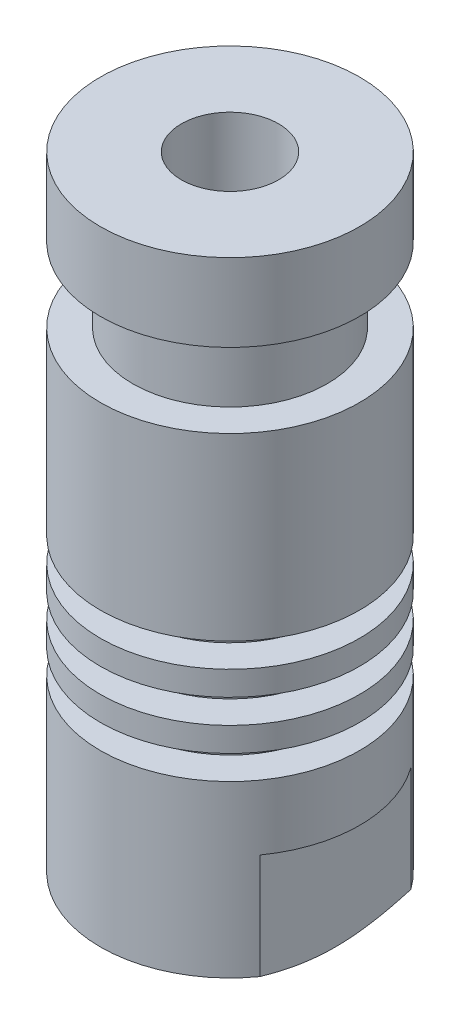
ISO-10303-21;
HEADER;
FILE_DESCRIPTION(('STEP AP214'),'2;1');
FILE_NAME('part.step','',(''),(''),'','','');
FILE_SCHEMA(('AUTOMOTIVE_DESIGN { 1 0 10303 214 1 1 1 1 }'));
ENDSEC;
DATA;
#1=APPLICATION_CONTEXT('core data for automotive mechanical design processes');
#2=APPLICATION_PROTOCOL_DEFINITION('international standard','automotive_design',2000,#1);
#3=PRODUCT_CONTEXT('',#1,'mechanical');
#4=PRODUCT('Part','Part','',(#3));
#5=PRODUCT_RELATED_PRODUCT_CATEGORY('part','',(#4));
#6=PRODUCT_DEFINITION_FORMATION('','',#4);
#7=PRODUCT_DEFINITION_CONTEXT('part definition',#1,'design');
#8=PRODUCT_DEFINITION('design','',#6,#7);
#9=PRODUCT_DEFINITION_SHAPE('','',#8);
#10=(LENGTH_UNIT() NAMED_UNIT(*) SI_UNIT(.MILLI.,.METRE.));
#11=(NAMED_UNIT(*) PLANE_ANGLE_UNIT() SI_UNIT($,.RADIAN.));
#12=(NAMED_UNIT(*) SI_UNIT($,.STERADIAN.) SOLID_ANGLE_UNIT());
#13=UNCERTAINTY_MEASURE_WITH_UNIT(LENGTH_MEASURE(1.E-05),#10,'distance_accuracy_value','');
#14=(GEOMETRIC_REPRESENTATION_CONTEXT(3) GLOBAL_UNCERTAINTY_ASSIGNED_CONTEXT((#13)) GLOBAL_UNIT_ASSIGNED_CONTEXT((#10,
#11,#12)) REPRESENTATION_CONTEXT('',''));
#15=CARTESIAN_POINT('',(0.,0.,0.));
#16=DIRECTION('',(0.,0.,1.));
#17=DIRECTION('',(1.,0.,0.));
#18=AXIS2_PLACEMENT_3D('',#15,#16,#17);
#19=CARTESIAN_POINT('',(0.,1.5,0.));
#20=DIRECTION('',(0.,1.,0.));
#21=DIRECTION('',(0.,0.,1.));
#22=AXIS2_PLACEMENT_3D('',#19,#20,#21);
#23=CONICAL_SURFACE('',#22,7.99999999999999,1.10714871779409);
#24=CARTESIAN_POINT('',(0.,0.,0.));
#25=DIRECTION('',(0.,1.,0.));
#26=DIRECTION('',(0.,0.,1.));
#27=AXIS2_PLACEMENT_3D('',#24,#25,#26);
#28=CIRCLE('',#27,4.99999999999998);
#29=CARTESIAN_POINT('',(0.,0.,4.99999999999998));
#30=VERTEX_POINT('',#29);
#31=EDGE_CURVE('E11',#30,#30,#28,.T.);
#32=ORIENTED_EDGE('',*,*,#31,.T.);
#33=EDGE_LOOP('',(#32));
#34=FACE_BOUND('',#33,.T.);
#35=CARTESIAN_POINT('',(0.,1.5,0.));
#36=DIRECTION('',(0.,1.,0.));
#37=DIRECTION('',(0.,0.,1.));
#38=AXIS2_PLACEMENT_3D('',#35,#36,#37);
#39=CIRCLE('',#38,7.99999999999999);
#40=CARTESIAN_POINT('',(6.49999999999997,1.5,-4.66368952654442));
#41=VERTEX_POINT('',#40);
#42=CARTESIAN_POINT('',(-6.49999999999997,1.5,-4.66368952654442));
#43=VERTEX_POINT('',#42);
#44=EDGE_CURVE('E91',#41,#43,#39,.T.);
#45=ORIENTED_EDGE('',*,*,#44,.F.);
#46=CARTESIAN_POINT('',(6.49999999999999,4.63960517836139,-12.7140020611741));
#47=CARTESIAN_POINT('',(6.49999999999999,4.49493273691476,-12.3889791438294));
#48=CARTESIAN_POINT('',(6.49999999999999,4.35117750702607,-12.0635434352985));
#49=CARTESIAN_POINT('',(6.49999999999999,4.06600795170587,-11.4116234990025));
#50=CARTESIAN_POINT('',(6.49999999999999,3.92459377917146,-11.0851392044028));
#51=CARTESIAN_POINT('',(6.49999999999999,3.64433543055072,-10.4302489102803));
#52=CARTESIAN_POINT('',(6.49999999999999,3.50549732908588,-10.1018403056813));
#53=CARTESIAN_POINT('',(6.49999999999999,3.23142571950738,-9.44352872623451));
#54=CARTESIAN_POINT('',(6.49999999999999,3.09619212071106,-9.11362578922608));
#55=CARTESIAN_POINT('',(6.49999999999999,2.83048289305681,-8.45250376338199));
#56=CARTESIAN_POINT('',(6.49999999999999,2.70000014874712,-8.12128754257229));
#57=CARTESIAN_POINT('',(6.49999999999999,2.44483186701764,-7.45659634827721));
#58=CARTESIAN_POINT('',(6.49999999999999,2.32014667007343,-7.12312124344746));
#59=CARTESIAN_POINT('',(6.49999999999999,2.07840099908305,-6.45372644486896));
#60=CARTESIAN_POINT('',(6.49999999999999,1.96133416663675,-6.11780905674865));
#61=CARTESIAN_POINT('',(6.49999999999999,1.73702665581905,-5.44272397498847));
#62=CARTESIAN_POINT('',(6.49999999999999,1.62978438251793,-5.10355681882979));
#63=CARTESIAN_POINT('',(6.49999999999999,1.50145760944831,-4.66929022803816));
#64=CARTESIAN_POINT('',(6.49999999999999,1.47439812441263,-4.57594563698323));
#65=CARTESIAN_POINT('',(6.49999999999999,1.42132141191772,-4.38896083134469));
#66=CARTESIAN_POINT('',(6.49999999999999,1.39530416853117,-4.29532062130229));
#67=CARTESIAN_POINT('',(6.49999999999999,1.31884649816979,-4.01363447591895));
#68=CARTESIAN_POINT('',(6.49999999999999,1.27009239909997,-3.82513345071698));
#69=CARTESIAN_POINT('',(6.49999999999999,1.13144347216063,-3.25712110004858));
#70=CARTESIAN_POINT('',(6.49999999999999,1.04932049996449,-2.87562365996438));
#71=CARTESIAN_POINT('',(6.49999999999999,0.946261094020701,-2.29977813127616));
#72=CARTESIAN_POINT('',(6.49999999999999,0.915259699355964,-2.10720712065049));
#73=CARTESIAN_POINT('',(6.49999999999999,0.860714592579146,-1.7210183720728));
#74=CARTESIAN_POINT('',(6.49999999999999,0.837170046736164,-1.52740075360301));
#75=CARTESIAN_POINT('',(6.49999999999999,0.798232474629815,-1.13985753736791));
#76=CARTESIAN_POINT('',(6.49999999999999,0.78281812154265,-0.945934097286736));
#77=CARTESIAN_POINT('',(6.49999999999999,0.760510527948946,-0.557594838663115));
#78=CARTESIAN_POINT('',(6.49999999999999,0.753617189046767,-0.363179025832271));
#79=CARTESIAN_POINT('',(6.49999999999999,0.748572275423311,0.0257307608028582));
#80=CARTESIAN_POINT('',(6.49999999999999,0.750419038007415,0.220224712703199));
#81=CARTESIAN_POINT('',(6.49999999999999,0.76278940638265,0.608953775199544));
#82=CARTESIAN_POINT('',(6.49999999999999,0.773314033718197,0.803188852624818));
#83=CARTESIAN_POINT('',(6.49999999999999,0.806501889662758,1.24090602694894));
#84=CARTESIAN_POINT('',(6.49999999999999,0.831590920516132,1.48420561931385));
#85=CARTESIAN_POINT('',(6.49999999999999,0.893852125406738,1.96924724220696));
#86=CARTESIAN_POINT('',(6.49999999999999,0.931025317420885,2.21098913976373));
#87=CARTESIAN_POINT('',(6.49999999999999,1.01604103903786,2.69277716302994));
#88=CARTESIAN_POINT('',(6.49999999999999,1.06389244038228,2.93282170644527));
#89=CARTESIAN_POINT('',(6.49999999999999,1.16871694054054,3.41088019593747));
#90=CARTESIAN_POINT('',(6.49999999999999,1.22568964445531,3.64889422945387));
#91=CARTESIAN_POINT('',(6.49999999999999,1.34820588611418,4.1264246278799));
#92=CARTESIAN_POINT('',(6.49999999999999,1.41386316573231,4.36591159529887));
#93=CARTESIAN_POINT('',(6.49999999999999,1.55170831935892,4.84285142414976));
#94=CARTESIAN_POINT('',(6.49999999999999,1.62389277522808,5.08030527977033));
#95=CARTESIAN_POINT('',(6.49999999999999,1.77367698683179,5.55344813381403));
#96=CARTESIAN_POINT('',(6.49999999999999,1.85127585874315,5.78913741335531));
#97=CARTESIAN_POINT('',(6.49999999999999,2.01097599435672,6.2590172847031));
#98=CARTESIAN_POINT('',(6.49999999999999,2.09307790629008,6.49320765528824));
#99=CARTESIAN_POINT('',(6.49999999999999,2.28703034641471,7.03262988490792));
#100=CARTESIAN_POINT('',(6.49999999999999,2.40021373679549,7.33738166221177));
#101=CARTESIAN_POINT('',(6.49999999999999,2.63161506867892,7.94497276131788));
#102=CARTESIAN_POINT('',(6.49999999999999,2.74983321640616,8.24781200419785));
#103=CARTESIAN_POINT('',(6.49999999999999,2.99028703034095,8.8519169939098));
#104=CARTESIAN_POINT('',(6.49999999999999,3.11252303289466,9.15318260654962));
#105=CARTESIAN_POINT('',(6.49999999999999,3.36022795848007,9.75438363657073));
#106=CARTESIAN_POINT('',(6.49999999999999,3.4856969285348,10.0543190345298));
#107=CARTESIAN_POINT('',(6.49999999999999,3.8662108131295,10.9529295272112));
#108=CARTESIAN_POINT('',(6.49999999999999,4.12517530296346,11.5499439611486));
#109=CARTESIAN_POINT('',(6.49999999999999,4.65016432189855,12.7407935160942));
#110=CARTESIAN_POINT('',(6.49999999999999,4.91618837224115,13.334628849434));
#111=CARTESIAN_POINT('',(6.49999999999999,5.43683739745572,14.4837436524848));
#112=CARTESIAN_POINT('',(6.49999999999999,5.69116368566189,15.0391586745477));
#113=CARTESIAN_POINT('',(6.49999999999999,6.20312748367828,16.148471829484));
#114=CARTESIAN_POINT('',(6.49999999999999,6.46076506083453,16.7023699312269));
#115=CARTESIAN_POINT('',(6.49999999999999,6.97809934492668,17.8080180985776));
#116=CARTESIAN_POINT('',(6.49999999999999,7.23779164660991,18.3597702278274));
#117=CARTESIAN_POINT('',(6.49999999999999,7.75914833515714,19.4623190137403));
#118=CARTESIAN_POINT('',(6.49999999999999,8.02081265352454,20.0131157027799));
#119=CARTESIAN_POINT('',(6.49999999999999,8.28320577924075,20.5635626171586));
#120=B_SPLINE_CURVE_WITH_KNOTS('',3,(#46,#47,#48,#49,#50,#51,#52,#53,#54,#55,#56,#57,#58,#59,
#60,#61,#62,#63,#64,#65,#66,#67,#68,#69,#70,#71,#72,#73,#74,#75,#76,#77,#78,#79,#80,#81,#82,#83,
#84,#85,#86,#87,#88,#89,#90,#91,#92,#93,#94,#95,#96,#97,#98,#99,#100,#101,#102,#103,#104,#105,
#106,#107,#108,#109,#110,#111,#112,#113,#114,#115,#116,#117,#118,#119),.UNSPECIFIED.,.F.,.F.,(4,
2,2,2,2,2,2,2,2,2,2,2,2,2,2,2,2,2,2,2,2,2,2,2,2,2,2,2,2,2,2,2,2,2,2,2,4),(0.,1.06730515758636,
2.13467974924004,3.20431402837474,4.27392137202762,5.34185467005331,6.40985060614333,
7.47694343200912,8.54386271672926,8.83542135077924,9.12697552758702,9.71105511301348,
10.8808525348457,11.4658873460732,12.0508567229673,12.6342839007031,13.2177043413035,
13.8010137979488,14.3843919306593,15.1178129637762,15.8512957967343,16.5853903108169,
17.31945305149,18.0643130987016,18.8087853133975,19.5531362870632,20.2975946957999,
21.2728075860352,22.2480604596634,23.2233951834841,24.1987441014193,26.1509456097113,
28.1030150621006,29.9356240477088,31.7682703646555,33.5977016553135,35.4270696921721),.UNSPECIFIED.);
#121=CARTESIAN_POINT('',(6.49999999999997,1.5,4.66368952654442));
#122=VERTEX_POINT('',#121);
#123=EDGE_CURVE('E76',#122,#41,#120,.F.);
#124=ORIENTED_EDGE('',*,*,#123,.F.);
#125=CARTESIAN_POINT('',(-6.49999999999997,1.5,4.66368952654442));
#126=VERTEX_POINT('',#125);
#127=EDGE_CURVE('E43',#126,#122,#39,.T.);
#128=ORIENTED_EDGE('',*,*,#127,.F.);
#129=CARTESIAN_POINT('',(-6.49999999999999,4.63960517836139,-12.7140020611741));
#130=CARTESIAN_POINT('',(-6.49999999999999,4.49493273691476,-12.3889791438294));
#131=CARTESIAN_POINT('',(-6.49999999999999,4.35117750702607,-12.0635434352985));
#132=CARTESIAN_POINT('',(-6.49999999999999,4.06600795170587,-11.4116234990025));
#133=CARTESIAN_POINT('',(-6.49999999999999,3.92459377917146,-11.0851392044028));
#134=CARTESIAN_POINT('',(-6.49999999999999,3.64433543055072,-10.4302489102803));
#135=CARTESIAN_POINT('',(-6.49999999999999,3.50549732908588,-10.1018403056813));
#136=CARTESIAN_POINT('',(-6.49999999999999,3.23142571950738,-9.44352872623451));
#137=CARTESIAN_POINT('',(-6.49999999999999,3.09619212071106,-9.11362578922608));
#138=CARTESIAN_POINT('',(-6.49999999999999,2.83048289305681,-8.45250376338199));
#139=CARTESIAN_POINT('',(-6.49999999999999,2.70000014874712,-8.12128754257229));
#140=CARTESIAN_POINT('',(-6.49999999999999,2.44483186701764,-7.45659634827721));
#141=CARTESIAN_POINT('',(-6.49999999999999,2.32014667007343,-7.12312124344746));
#142=CARTESIAN_POINT('',(-6.49999999999999,2.07840099908305,-6.45372644486896));
#143=CARTESIAN_POINT('',(-6.49999999999999,1.96133416663675,-6.11780905674865));
#144=CARTESIAN_POINT('',(-6.49999999999999,1.73702665581905,-5.44272397498847));
#145=CARTESIAN_POINT('',(-6.49999999999999,1.62978438251793,-5.10355681882979));
#146=CARTESIAN_POINT('',(-6.49999999999999,1.50145760944831,-4.66929022803816));
#147=CARTESIAN_POINT('',(-6.49999999999999,1.47439812441263,-4.57594563698323));
#148=CARTESIAN_POINT('',(-6.49999999999999,1.42132141191772,-4.38896083134469));
#149=CARTESIAN_POINT('',(-6.49999999999999,1.39530416853117,-4.29532062130229));
#150=CARTESIAN_POINT('',(-6.49999999999999,1.31884649816979,-4.01363447591895));
#151=CARTESIAN_POINT('',(-6.49999999999999,1.27009239909997,-3.82513345071698));
#152=CARTESIAN_POINT('',(-6.49999999999999,1.13144347216063,-3.25712110004858));
#153=CARTESIAN_POINT('',(-6.49999999999999,1.04932049996449,-2.87562365996438));
#154=CARTESIAN_POINT('',(-6.49999999999999,0.946261094020701,-2.29977813127616));
#155=CARTESIAN_POINT('',(-6.49999999999999,0.915259699355964,-2.10720712065049));
#156=CARTESIAN_POINT('',(-6.49999999999999,0.860714592579146,-1.7210183720728));
#157=CARTESIAN_POINT('',(-6.49999999999999,0.837170046736164,-1.52740075360301));
#158=CARTESIAN_POINT('',(-6.49999999999999,0.798232474629815,-1.13985753736791));
#159=CARTESIAN_POINT('',(-6.49999999999999,0.78281812154265,-0.945934097286736));
#160=CARTESIAN_POINT('',(-6.49999999999999,0.760510527948946,-0.557594838663115));
#161=CARTESIAN_POINT('',(-6.49999999999999,0.753617189046767,-0.363179025832271));
#162=CARTESIAN_POINT('',(-6.49999999999999,0.748572275423311,0.0257307608028582));
#163=CARTESIAN_POINT('',(-6.49999999999999,0.750419038007415,0.220224712703199));
#164=CARTESIAN_POINT('',(-6.49999999999999,0.76278940638265,0.608953775199544));
#165=CARTESIAN_POINT('',(-6.49999999999999,0.773314033718197,0.803188852624818));
#166=CARTESIAN_POINT('',(-6.49999999999999,0.806501889662758,1.24090602694894));
#167=CARTESIAN_POINT('',(-6.49999999999999,0.831590920516132,1.48420561931385));
#168=CARTESIAN_POINT('',(-6.49999999999999,0.893852125406738,1.96924724220696));
#169=CARTESIAN_POINT('',(-6.49999999999999,0.931025317420885,2.21098913976373));
#170=CARTESIAN_POINT('',(-6.49999999999999,1.01604103903786,2.69277716302994));
#171=CARTESIAN_POINT('',(-6.49999999999999,1.06389244038228,2.93282170644527));
#172=CARTESIAN_POINT('',(-6.49999999999999,1.16871694054054,3.41088019593747));
#173=CARTESIAN_POINT('',(-6.49999999999999,1.22568964445531,3.64889422945387));
#174=CARTESIAN_POINT('',(-6.49999999999999,1.34820588611418,4.1264246278799));
#175=CARTESIAN_POINT('',(-6.49999999999999,1.41386316573231,4.36591159529887));
#176=CARTESIAN_POINT('',(-6.49999999999999,1.55170831935892,4.84285142414976));
#177=CARTESIAN_POINT('',(-6.49999999999999,1.62389277522808,5.08030527977033));
#178=CARTESIAN_POINT('',(-6.49999999999999,1.77367698683179,5.55344813381403));
#179=CARTESIAN_POINT('',(-6.49999999999999,1.85127585874315,5.78913741335531));
#180=CARTESIAN_POINT('',(-6.49999999999999,2.01097599435672,6.2590172847031));
#181=CARTESIAN_POINT('',(-6.49999999999999,2.09307790629008,6.49320765528824));
#182=CARTESIAN_POINT('',(-6.49999999999999,2.28703034641471,7.03262988490792));
#183=CARTESIAN_POINT('',(-6.49999999999999,2.40021373679549,7.33738166221177));
#184=CARTESIAN_POINT('',(-6.49999999999999,2.63161506867892,7.94497276131788));
#185=CARTESIAN_POINT('',(-6.49999999999999,2.74983321640616,8.24781200419785));
#186=CARTESIAN_POINT('',(-6.49999999999999,2.99028703034095,8.8519169939098));
#187=CARTESIAN_POINT('',(-6.49999999999999,3.11252303289466,9.15318260654962));
#188=CARTESIAN_POINT('',(-6.49999999999999,3.36022795848007,9.75438363657073));
#189=CARTESIAN_POINT('',(-6.49999999999999,3.4856969285348,10.0543190345298));
#190=CARTESIAN_POINT('',(-6.49999999999999,3.8662108131295,10.9529295272112));
#191=CARTESIAN_POINT('',(-6.49999999999999,4.12517530296346,11.5499439611486));
#192=CARTESIAN_POINT('',(-6.49999999999999,4.65016432189855,12.7407935160942));
#193=CARTESIAN_POINT('',(-6.49999999999999,4.91618837224115,13.334628849434));
#194=CARTESIAN_POINT('',(-6.49999999999999,5.43683739745572,14.4837436524848));
#195=CARTESIAN_POINT('',(-6.49999999999999,5.69116368566189,15.0391586745477));
#196=CARTESIAN_POINT('',(-6.49999999999999,6.20312748367828,16.148471829484));
#197=CARTESIAN_POINT('',(-6.49999999999999,6.46076506083453,16.7023699312269));
#198=CARTESIAN_POINT('',(-6.49999999999999,6.97809934492668,17.8080180985776));
#199=CARTESIAN_POINT('',(-6.49999999999999,7.23779164660991,18.3597702278274));
#200=CARTESIAN_POINT('',(-6.49999999999999,7.75914833515714,19.4623190137403));
#201=CARTESIAN_POINT('',(-6.49999999999999,8.02081265352454,20.0131157027799));
#202=CARTESIAN_POINT('',(-6.49999999999999,8.28320577924075,20.5635626171586));
#203=B_SPLINE_CURVE_WITH_KNOTS('',3,(#129,#130,#131,#132,#133,#134,#135,#136,#137,#138,#139,
#140,#141,#142,#143,#144,#145,#146,#147,#148,#149,#150,#151,#152,#153,#154,#155,#156,#157,#158,
#159,#160,#161,#162,#163,#164,#165,#166,#167,#168,#169,#170,#171,#172,#173,#174,#175,#176,#177,
#178,#179,#180,#181,#182,#183,#184,#185,#186,#187,#188,#189,#190,#191,#192,#193,#194,#195,#196,
#197,#198,#199,#200,#201,#202),.UNSPECIFIED.,.F.,.F.,(4,2,2,2,2,2,2,2,2,2,2,2,2,2,2,2,2,2,2,2,2,
2,2,2,2,2,2,2,2,2,2,2,2,2,2,2,4),(0.,1.06730515758636,2.13467974924004,3.20431402837474,
4.27392137202762,5.34185467005331,6.40985060614333,7.47694343200912,8.54386271672926,
8.83542135077924,9.12697552758702,9.71105511301348,10.8808525348457,11.4658873460732,
12.0508567229673,12.6342839007031,13.2177043413035,13.8010137979488,14.3843919306593,
15.1178129637762,15.8512957967343,16.5853903108169,17.31945305149,18.0643130987016,
18.8087853133975,19.5531362870632,20.2975946957999,21.2728075860352,22.2480604596634,
23.2233951834841,24.1987441014193,26.1509456097113,28.1030150621006,29.9356240477088,
31.7682703646555,33.5977016553135,35.4270696921721),.UNSPECIFIED.);
#204=EDGE_CURVE('E96',#43,#126,#203,.T.);
#205=ORIENTED_EDGE('',*,*,#204,.F.);
#206=EDGE_LOOP('',(#45,#124,#128,#205));
#207=FACE_BOUND('',#206,.T.);
#208=ADVANCED_FACE('F34',(#34,#207),#23,.T.);
#209=CARTESIAN_POINT('',(0.,129.407380346339,0.));
#210=DIRECTION('',(0.,1.,0.));
#211=DIRECTION('',(0.,0.,1.));
#212=AXIS2_PLACEMENT_3D('',#209,#210,#211);
#213=CYLINDRICAL_SURFACE('',#212,7.99999999999999);
#214=CARTESIAN_POINT('',(0.,12.,0.));
#215=DIRECTION('',(0.,1.,0.));
#216=DIRECTION('',(0.,0.,1.));
#217=AXIS2_PLACEMENT_3D('',#214,#215,#216);
#218=CIRCLE('',#217,7.99999999999998);
#219=CARTESIAN_POINT('',(0.,12.,7.99999999999998));
#220=VERTEX_POINT('',#219);
#221=EDGE_CURVE('E97',#220,#220,#218,.T.);
#222=ORIENTED_EDGE('',*,*,#221,.F.);
#223=EDGE_LOOP('',(#222));
#224=FACE_BOUND('',#223,.T.);
#225=CARTESIAN_POINT('',(0.,7.99999999999999,0.));
#226=DIRECTION('',(0.,-1.,0.));
#227=DIRECTION('',(0.,0.,-1.));
#228=AXIS2_PLACEMENT_3D('',#225,#226,#227);
#229=CIRCLE('',#228,7.99999999999999);
#230=CARTESIAN_POINT('',(6.49999999999999,7.99999999999999,-4.6636895265444));
#231=VERTEX_POINT('',#230);
#232=CARTESIAN_POINT('',(6.49999999999997,7.99999999999999,4.66368952654442));
#233=VERTEX_POINT('',#232);
#234=EDGE_CURVE('E49',#231,#233,#229,.T.);
#235=ORIENTED_EDGE('',*,*,#234,.F.);
#236=DIRECTION('',(0.,1.,0.));
#237=VECTOR('',#236,1.);
#238=CARTESIAN_POINT('',(6.49999999999997,129.407380346339,-4.66368952654442));
#239=LINE('',#238,#237);
#240=EDGE_CURVE('E79',#231,#41,#239,.F.);
#241=ORIENTED_EDGE('',*,*,#240,.T.);
#242=ORIENTED_EDGE('',*,*,#44,.T.);
#243=DIRECTION('',(0.,1.,0.));
#244=VECTOR('',#243,1.);
#245=CARTESIAN_POINT('',(-6.49999999999997,129.407380346339,-4.66368952654442));
#246=LINE('',#245,#244);
#247=CARTESIAN_POINT('',(-6.49999999999999,7.99999999999999,-4.6636895265444));
#248=VERTEX_POINT('',#247);
#249=EDGE_CURVE('E455',#43,#248,#246,.T.);
#250=ORIENTED_EDGE('',*,*,#249,.T.);
#251=CARTESIAN_POINT('',(0.,7.99999999999998,0.));
#252=DIRECTION('',(0.,-1.,0.));
#253=DIRECTION('',(1.,0.,0.));
#254=AXIS2_PLACEMENT_3D('',#251,#252,#253);
#255=CIRCLE('',#254,7.99999999999999);
#256=CARTESIAN_POINT('',(-6.49999999999999,7.99999999999999,4.6636895265444));
#257=VERTEX_POINT('',#256);
#258=EDGE_CURVE('E456',#257,#248,#255,.T.);
#259=ORIENTED_EDGE('',*,*,#258,.F.);
#260=DIRECTION('',(0.,1.,0.));
#261=VECTOR('',#260,1.);
#262=CARTESIAN_POINT('',(-6.49999999999997,129.407380346339,4.66368952654442));
#263=LINE('',#262,#261);
#264=EDGE_CURVE('E57',#126,#257,#263,.T.);
#265=ORIENTED_EDGE('',*,*,#264,.F.);
#266=ORIENTED_EDGE('',*,*,#127,.T.);
#267=DIRECTION('',(0.,1.,0.));
#268=VECTOR('',#267,1.);
#269=CARTESIAN_POINT('',(6.49999999999997,129.407380346339,4.66368952654442));
#270=LINE('',#269,#268);
#271=EDGE_CURVE('E81',#233,#122,#270,.F.);
#272=ORIENTED_EDGE('',*,*,#271,.F.);
#273=EDGE_LOOP('',(#235,#241,#242,#250,#259,#265,#266,#272));
#274=FACE_BOUND('',#273,.T.);
#275=ADVANCED_FACE('F89',(#224,#274),#213,.T.);
#276=CARTESIAN_POINT('',(0.,0.,0.));
#277=DIRECTION('',(0.,-1.,0.));
#278=DIRECTION('',(0.,0.,-1.));
#279=AXIS2_PLACEMENT_3D('',#276,#277,#278);
#280=PLANE('',#279);
#281=CARTESIAN_POINT('',(0.,0.,0.));
#282=DIRECTION('',(0.,-1.,0.));
#283=DIRECTION('',(0.,0.,-1.));
#284=AXIS2_PLACEMENT_3D('',#281,#282,#283);
#285=CIRCLE('',#284,3.39999999999999);
#286=CARTESIAN_POINT('',(0.,0.,-3.39999999999999));
#287=VERTEX_POINT('',#286);
#288=EDGE_CURVE('E296',#287,#287,#285,.T.);
#289=ORIENTED_EDGE('',*,*,#288,.F.);
#290=EDGE_LOOP('',(#289));
#291=FACE_BOUND('',#290,.T.);
#292=ORIENTED_EDGE('',*,*,#31,.F.);
#293=EDGE_LOOP('',(#292));
#294=FACE_BOUND('',#293,.T.);
#295=ADVANCED_FACE('F36',(#291,#294),#280,.T.);
#296=CARTESIAN_POINT('',(-7.99999999999998,12.,0.));
#297=DIRECTION('',(0.,1.,0.));
#298=DIRECTION('',(0.,0.,1.));
#299=AXIS2_PLACEMENT_3D('',#296,#297,#298);
#300=PLANE('',#299);
#301=ORIENTED_EDGE('',*,*,#221,.T.);
#302=EDGE_LOOP('',(#301));
#303=FACE_BOUND('',#302,.T.);
#304=CARTESIAN_POINT('',(0.,12.,0.));
#305=DIRECTION('',(0.,1.,0.));
#306=DIRECTION('',(0.,0.,1.));
#307=AXIS2_PLACEMENT_3D('',#304,#305,#306);
#308=CIRCLE('',#307,5.99999999999998);
#309=CARTESIAN_POINT('',(0.,12.,5.99999999999998));
#310=VERTEX_POINT('',#309);
#311=EDGE_CURVE('E100',#310,#310,#308,.T.);
#312=ORIENTED_EDGE('',*,*,#311,.F.);
#313=EDGE_LOOP('',(#312));
#314=FACE_BOUND('',#313,.T.);
#315=ADVANCED_FACE('F184',(#303,#314),#300,.T.);
#316=CARTESIAN_POINT('',(0.,129.407380346339,0.));
#317=DIRECTION('',(0.,1.,0.));
#318=DIRECTION('',(0.,0.,1.));
#319=AXIS2_PLACEMENT_3D('',#316,#317,#318);
#320=CYLINDRICAL_SURFACE('',#319,5.99999999999999);
#321=ORIENTED_EDGE('',*,*,#311,.T.);
#322=EDGE_LOOP('',(#321));
#323=FACE_BOUND('',#322,.T.);
#324=CARTESIAN_POINT('',(0.,13.5,0.));
#325=DIRECTION('',(0.,1.,0.));
#326=DIRECTION('',(0.,0.,1.));
#327=AXIS2_PLACEMENT_3D('',#324,#325,#326);
#328=CIRCLE('',#327,6.);
#329=CARTESIAN_POINT('',(0.,13.5,6.));
#330=VERTEX_POINT('',#329);
#331=EDGE_CURVE('E105',#330,#330,#328,.T.);
#332=ORIENTED_EDGE('',*,*,#331,.F.);
#333=EDGE_LOOP('',(#332));
#334=FACE_BOUND('',#333,.T.);
#335=ADVANCED_FACE('F187',(#323,#334),#320,.T.);
#336=CARTESIAN_POINT('',(-6.,13.5,0.));
#337=DIRECTION('',(0.,-1.,0.));
#338=DIRECTION('',(0.,0.,-1.));
#339=AXIS2_PLACEMENT_3D('',#336,#337,#338);
#340=PLANE('',#339);
#341=ORIENTED_EDGE('',*,*,#331,.T.);
#342=EDGE_LOOP('',(#341));
#343=FACE_BOUND('',#342,.T.);
#344=CARTESIAN_POINT('',(0.,13.5,0.));
#345=DIRECTION('',(0.,1.,0.));
#346=DIRECTION('',(0.,0.,1.));
#347=AXIS2_PLACEMENT_3D('',#344,#345,#346);
#348=CIRCLE('',#347,8.);
#349=CARTESIAN_POINT('',(0.,13.5,8.));
#350=VERTEX_POINT('',#349);
#351=EDGE_CURVE('E108',#350,#350,#348,.T.);
#352=ORIENTED_EDGE('',*,*,#351,.F.);
#353=EDGE_LOOP('',(#352));
#354=FACE_BOUND('',#353,.T.);
#355=ADVANCED_FACE('F191',(#343,#354),#340,.T.);
#356=CARTESIAN_POINT('',(0.,129.407380346339,0.));
#357=DIRECTION('',(0.,1.,0.));
#358=DIRECTION('',(0.,0.,1.));
#359=AXIS2_PLACEMENT_3D('',#356,#357,#358);
#360=CYLINDRICAL_SURFACE('',#359,8.);
#361=ORIENTED_EDGE('',*,*,#351,.T.);
#362=EDGE_LOOP('',(#361));
#363=FACE_BOUND('',#362,.T.);
#364=CARTESIAN_POINT('',(0.,15.,0.));
#365=DIRECTION('',(0.,1.,0.));
#366=DIRECTION('',(0.,0.,1.));
#367=AXIS2_PLACEMENT_3D('',#364,#365,#366);
#368=CIRCLE('',#367,8.);
#369=CARTESIAN_POINT('',(0.,15.,8.));
#370=VERTEX_POINT('',#369);
#371=EDGE_CURVE('E111',#370,#370,#368,.T.);
#372=ORIENTED_EDGE('',*,*,#371,.F.);
#373=EDGE_LOOP('',(#372));
#374=FACE_BOUND('',#373,.T.);
#375=ADVANCED_FACE('F195',(#363,#374),#360,.T.);
#376=CARTESIAN_POINT('',(-8.,15.,0.));
#377=DIRECTION('',(0.,1.,0.));
#378=DIRECTION('',(0.,0.,1.));
#379=AXIS2_PLACEMENT_3D('',#376,#377,#378);
#380=PLANE('',#379);
#381=ORIENTED_EDGE('',*,*,#371,.T.);
#382=EDGE_LOOP('',(#381));
#383=FACE_BOUND('',#382,.T.);
#384=CARTESIAN_POINT('',(0.,15.,0.));
#385=DIRECTION('',(0.,1.,0.));
#386=DIRECTION('',(0.,0.,1.));
#387=AXIS2_PLACEMENT_3D('',#384,#385,#386);
#388=CIRCLE('',#387,6.);
#389=CARTESIAN_POINT('',(0.,15.,6.));
#390=VERTEX_POINT('',#389);
#391=EDGE_CURVE('E114',#390,#390,#388,.T.);
#392=ORIENTED_EDGE('',*,*,#391,.F.);
#393=EDGE_LOOP('',(#392));
#394=FACE_BOUND('',#393,.T.);
#395=ADVANCED_FACE('F199',(#383,#394),#380,.T.);
#396=CARTESIAN_POINT('',(0.,129.407380346339,0.));
#397=DIRECTION('',(0.,1.,0.));
#398=DIRECTION('',(0.,0.,1.));
#399=AXIS2_PLACEMENT_3D('',#396,#397,#398);
#400=CYLINDRICAL_SURFACE('',#399,6.);
#401=ORIENTED_EDGE('',*,*,#391,.T.);
#402=EDGE_LOOP('',(#401));
#403=FACE_BOUND('',#402,.T.);
#404=CARTESIAN_POINT('',(0.,16.5,0.));
#405=DIRECTION('',(0.,1.,0.));
#406=DIRECTION('',(0.,0.,1.));
#407=AXIS2_PLACEMENT_3D('',#404,#405,#406);
#408=CIRCLE('',#407,6.);
#409=CARTESIAN_POINT('',(0.,16.5,6.));
#410=VERTEX_POINT('',#409);
#411=EDGE_CURVE('E117',#410,#410,#408,.T.);
#412=ORIENTED_EDGE('',*,*,#411,.F.);
#413=EDGE_LOOP('',(#412));
#414=FACE_BOUND('',#413,.T.);
#415=ADVANCED_FACE('F203',(#403,#414),#400,.T.);
#416=CARTESIAN_POINT('',(-6.,16.5,0.));
#417=DIRECTION('',(0.,-1.,0.));
#418=DIRECTION('',(0.,0.,-1.));
#419=AXIS2_PLACEMENT_3D('',#416,#417,#418);
#420=PLANE('',#419);
#421=ORIENTED_EDGE('',*,*,#411,.T.);
#422=EDGE_LOOP('',(#421));
#423=FACE_BOUND('',#422,.T.);
#424=CARTESIAN_POINT('',(0.,16.5,0.));
#425=DIRECTION('',(0.,1.,0.));
#426=DIRECTION('',(0.,0.,1.));
#427=AXIS2_PLACEMENT_3D('',#424,#425,#426);
#428=CIRCLE('',#427,8.);
#429=CARTESIAN_POINT('',(0.,16.5,8.));
#430=VERTEX_POINT('',#429);
#431=EDGE_CURVE('E120',#430,#430,#428,.T.);
#432=ORIENTED_EDGE('',*,*,#431,.F.);
#433=EDGE_LOOP('',(#432));
#434=FACE_BOUND('',#433,.T.);
#435=ADVANCED_FACE('F207',(#423,#434),#420,.T.);
#436=CARTESIAN_POINT('',(0.,129.407380346339,0.));
#437=DIRECTION('',(0.,1.,0.));
#438=DIRECTION('',(0.,0.,1.));
#439=AXIS2_PLACEMENT_3D('',#436,#437,#438);
#440=CYLINDRICAL_SURFACE('',#439,8.);
#441=ORIENTED_EDGE('',*,*,#431,.T.);
#442=EDGE_LOOP('',(#441));
#443=FACE_BOUND('',#442,.T.);
#444=CARTESIAN_POINT('',(0.,18.,0.));
#445=DIRECTION('',(0.,1.,0.));
#446=DIRECTION('',(0.,0.,1.));
#447=AXIS2_PLACEMENT_3D('',#444,#445,#446);
#448=CIRCLE('',#447,8.);
#449=CARTESIAN_POINT('',(0.,18.,8.));
#450=VERTEX_POINT('',#449);
#451=EDGE_CURVE('E123',#450,#450,#448,.T.);
#452=ORIENTED_EDGE('',*,*,#451,.F.);
#453=EDGE_LOOP('',(#452));
#454=FACE_BOUND('',#453,.T.);
#455=ADVANCED_FACE('F211',(#443,#454),#440,.T.);
#456=CARTESIAN_POINT('',(-8.,18.,0.));
#457=DIRECTION('',(0.,1.,0.));
#458=DIRECTION('',(0.,0.,1.));
#459=AXIS2_PLACEMENT_3D('',#456,#457,#458);
#460=PLANE('',#459);
#461=ORIENTED_EDGE('',*,*,#451,.T.);
#462=EDGE_LOOP('',(#461));
#463=FACE_BOUND('',#462,.T.);
#464=CARTESIAN_POINT('',(0.,18.,0.));
#465=DIRECTION('',(0.,1.,0.));
#466=DIRECTION('',(0.,0.,1.));
#467=AXIS2_PLACEMENT_3D('',#464,#465,#466);
#468=CIRCLE('',#467,6.);
#469=CARTESIAN_POINT('',(0.,18.,6.));
#470=VERTEX_POINT('',#469);
#471=EDGE_CURVE('E126',#470,#470,#468,.T.);
#472=ORIENTED_EDGE('',*,*,#471,.F.);
#473=EDGE_LOOP('',(#472));
#474=FACE_BOUND('',#473,.T.);
#475=ADVANCED_FACE('F215',(#463,#474),#460,.T.);
#476=CARTESIAN_POINT('',(0.,129.407380346339,0.));
#477=DIRECTION('',(0.,1.,0.));
#478=DIRECTION('',(0.,0.,1.));
#479=AXIS2_PLACEMENT_3D('',#476,#477,#478);
#480=CYLINDRICAL_SURFACE('',#479,6.);
#481=ORIENTED_EDGE('',*,*,#471,.T.);
#482=EDGE_LOOP('',(#481));
#483=FACE_BOUND('',#482,.T.);
#484=CARTESIAN_POINT('',(0.,19.5,0.));
#485=DIRECTION('',(0.,1.,0.));
#486=DIRECTION('',(0.,0.,1.));
#487=AXIS2_PLACEMENT_3D('',#484,#485,#486);
#488=CIRCLE('',#487,6.);
#489=CARTESIAN_POINT('',(0.,19.5,6.));
#490=VERTEX_POINT('',#489);
#491=EDGE_CURVE('E129',#490,#490,#488,.T.);
#492=ORIENTED_EDGE('',*,*,#491,.F.);
#493=EDGE_LOOP('',(#492));
#494=FACE_BOUND('',#493,.T.);
#495=ADVANCED_FACE('F219',(#483,#494),#480,.T.);
#496=CARTESIAN_POINT('',(-6.,19.5,0.));
#497=DIRECTION('',(0.,-1.,0.));
#498=DIRECTION('',(0.,0.,-1.));
#499=AXIS2_PLACEMENT_3D('',#496,#497,#498);
#500=PLANE('',#499);
#501=ORIENTED_EDGE('',*,*,#491,.T.);
#502=EDGE_LOOP('',(#501));
#503=FACE_BOUND('',#502,.T.);
#504=CARTESIAN_POINT('',(0.,19.5,0.));
#505=DIRECTION('',(0.,1.,0.));
#506=DIRECTION('',(0.,0.,1.));
#507=AXIS2_PLACEMENT_3D('',#504,#505,#506);
#508=CIRCLE('',#507,8.);
#509=CARTESIAN_POINT('',(0.,19.5,8.));
#510=VERTEX_POINT('',#509);
#511=EDGE_CURVE('E132',#510,#510,#508,.T.);
#512=ORIENTED_EDGE('',*,*,#511,.F.);
#513=EDGE_LOOP('',(#512));
#514=FACE_BOUND('',#513,.T.);
#515=ADVANCED_FACE('F223',(#503,#514),#500,.T.);
#516=CARTESIAN_POINT('',(0.,129.407380346339,0.));
#517=DIRECTION('',(0.,1.,0.));
#518=DIRECTION('',(0.,0.,1.));
#519=AXIS2_PLACEMENT_3D('',#516,#517,#518);
#520=CYLINDRICAL_SURFACE('',#519,8.);
#521=ORIENTED_EDGE('',*,*,#511,.T.);
#522=EDGE_LOOP('',(#521));
#523=FACE_BOUND('',#522,.T.);
#524=CARTESIAN_POINT('',(0.,30.6,0.));
#525=DIRECTION('',(0.,1.,0.));
#526=DIRECTION('',(0.,0.,1.));
#527=AXIS2_PLACEMENT_3D('',#524,#525,#526);
#528=CIRCLE('',#527,8.);
#529=CARTESIAN_POINT('',(0.,30.6,8.));
#530=VERTEX_POINT('',#529);
#531=EDGE_CURVE('E135',#530,#530,#528,.T.);
#532=ORIENTED_EDGE('',*,*,#531,.F.);
#533=EDGE_LOOP('',(#532));
#534=FACE_BOUND('',#533,.T.);
#535=ADVANCED_FACE('F227',(#523,#534),#520,.T.);
#536=CARTESIAN_POINT('',(-8.,30.6,0.));
#537=DIRECTION('',(0.,1.,0.));
#538=DIRECTION('',(0.,0.,1.));
#539=AXIS2_PLACEMENT_3D('',#536,#537,#538);
#540=PLANE('',#539);
#541=ORIENTED_EDGE('',*,*,#531,.T.);
#542=EDGE_LOOP('',(#541));
#543=FACE_BOUND('',#542,.T.);
#544=CARTESIAN_POINT('',(0.,30.6,0.));
#545=DIRECTION('',(0.,1.,0.));
#546=DIRECTION('',(0.,0.,1.));
#547=AXIS2_PLACEMENT_3D('',#544,#545,#546);
#548=CIRCLE('',#547,6.);
#549=CARTESIAN_POINT('',(0.,30.6,6.));
#550=VERTEX_POINT('',#549);
#551=EDGE_CURVE('E138',#550,#550,#548,.T.);
#552=ORIENTED_EDGE('',*,*,#551,.F.);
#553=EDGE_LOOP('',(#552));
#554=FACE_BOUND('',#553,.T.);
#555=ADVANCED_FACE('F231',(#543,#554),#540,.T.);
#556=CARTESIAN_POINT('',(0.,129.407380346339,0.));
#557=DIRECTION('',(0.,1.,0.));
#558=DIRECTION('',(0.,0.,1.));
#559=AXIS2_PLACEMENT_3D('',#556,#557,#558);
#560=CYLINDRICAL_SURFACE('',#559,6.);
#561=ORIENTED_EDGE('',*,*,#551,.T.);
#562=EDGE_LOOP('',(#561));
#563=FACE_BOUND('',#562,.T.);
#564=CARTESIAN_POINT('',(0.,35.2,0.));
#565=DIRECTION('',(0.,1.,0.));
#566=DIRECTION('',(0.,0.,1.));
#567=AXIS2_PLACEMENT_3D('',#564,#565,#566);
#568=CIRCLE('',#567,6.);
#569=CARTESIAN_POINT('',(0.,35.2,6.));
#570=VERTEX_POINT('',#569);
#571=EDGE_CURVE('E141',#570,#570,#568,.T.);
#572=ORIENTED_EDGE('',*,*,#571,.F.);
#573=EDGE_LOOP('',(#572));
#574=FACE_BOUND('',#573,.T.);
#575=ADVANCED_FACE('F235',(#563,#574),#560,.T.);
#576=CARTESIAN_POINT('',(-6.,35.2,0.));
#577=DIRECTION('',(0.,-1.,0.));
#578=DIRECTION('',(0.,0.,-1.));
#579=AXIS2_PLACEMENT_3D('',#576,#577,#578);
#580=PLANE('',#579);
#581=ORIENTED_EDGE('',*,*,#571,.T.);
#582=EDGE_LOOP('',(#581));
#583=FACE_BOUND('',#582,.T.);
#584=CARTESIAN_POINT('',(0.,35.2,0.));
#585=DIRECTION('',(0.,1.,0.));
#586=DIRECTION('',(0.,0.,1.));
#587=AXIS2_PLACEMENT_3D('',#584,#585,#586);
#588=CIRCLE('',#587,8.);
#589=CARTESIAN_POINT('',(0.,35.2,8.));
#590=VERTEX_POINT('',#589);
#591=EDGE_CURVE('E144',#590,#590,#588,.T.);
#592=ORIENTED_EDGE('',*,*,#591,.F.);
#593=EDGE_LOOP('',(#592));
#594=FACE_BOUND('',#593,.T.);
#595=ADVANCED_FACE('F239',(#583,#594),#580,.T.);
#596=CARTESIAN_POINT('',(0.,129.407380346339,0.));
#597=DIRECTION('',(0.,1.,0.));
#598=DIRECTION('',(0.,0.,1.));
#599=AXIS2_PLACEMENT_3D('',#596,#597,#598);
#600=CYLINDRICAL_SURFACE('',#599,7.99999999999999);
#601=ORIENTED_EDGE('',*,*,#591,.T.);
#602=EDGE_LOOP('',(#601));
#603=FACE_BOUND('',#602,.T.);
#604=CARTESIAN_POINT('',(0.,40.,0.));
#605=DIRECTION('',(0.,1.,0.));
#606=DIRECTION('',(0.,0.,1.));
#607=AXIS2_PLACEMENT_3D('',#604,#605,#606);
#608=CIRCLE('',#607,7.99999999999998);
#609=CARTESIAN_POINT('',(0.,40.,7.99999999999998));
#610=VERTEX_POINT('',#609);
#611=EDGE_CURVE('E147',#610,#610,#608,.T.);
#612=ORIENTED_EDGE('',*,*,#611,.F.);
#613=EDGE_LOOP('',(#612));
#614=FACE_BOUND('',#613,.T.);
#615=ADVANCED_FACE('F243',(#603,#614),#600,.T.);
#616=CARTESIAN_POINT('',(-7.99999999999998,40.,0.));
#617=DIRECTION('',(0.,1.,0.));
#618=DIRECTION('',(0.,0.,1.));
#619=AXIS2_PLACEMENT_3D('',#616,#617,#618);
#620=PLANE('',#619);
#621=CARTESIAN_POINT('',(0.,40.,0.));
#622=DIRECTION('',(0.,1.,0.));
#623=DIRECTION('',(0.,0.,1.));
#624=AXIS2_PLACEMENT_3D('',#621,#622,#623);
#625=CIRCLE('',#624,3.);
#626=CARTESIAN_POINT('',(0.,40.,3.));
#627=VERTEX_POINT('',#626);
#628=EDGE_CURVE('E93',#627,#627,#625,.T.);
#629=ORIENTED_EDGE('',*,*,#628,.F.);
#630=EDGE_LOOP('',(#629));
#631=FACE_BOUND('',#630,.T.);
#632=ORIENTED_EDGE('',*,*,#611,.T.);
#633=EDGE_LOOP('',(#632));
#634=FACE_BOUND('',#633,.T.);
#635=ADVANCED_FACE('F174',(#631,#634),#620,.T.);
#636=CARTESIAN_POINT('',(-6.49999999999999,7.99999999999999,8.001));
#637=DIRECTION('',(-1.,0.,0.));
#638=DIRECTION('',(0.,-1.,0.));
#639=AXIS2_PLACEMENT_3D('',#636,#637,#638);
#640=PLANE('',#639);
#641=ORIENTED_EDGE('',*,*,#204,.T.);
#642=ORIENTED_EDGE('',*,*,#264,.T.);
#643=DIRECTION('',(0.,0.,-1.));
#644=VECTOR('',#643,1.);
#645=CARTESIAN_POINT('',(-6.49999999999999,7.99999999999999,8.001));
#646=LINE('',#645,#644);
#647=EDGE_CURVE('E150',#257,#248,#646,.T.);
#648=ORIENTED_EDGE('',*,*,#647,.T.);
#649=ORIENTED_EDGE('',*,*,#249,.F.);
#650=EDGE_LOOP('',(#641,#642,#648,#649));
#651=FACE_BOUND('',#650,.T.);
#652=ADVANCED_FACE('F159',(#651),#640,.T.);
#653=CARTESIAN_POINT('',(-7.99999999999999,7.99999999999999,8.001));
#654=DIRECTION('',(0.,-1.,0.));
#655=DIRECTION('',(1.,0.,0.));
#656=AXIS2_PLACEMENT_3D('',#653,#654,#655);
#657=PLANE('',#656);
#658=ORIENTED_EDGE('',*,*,#258,.T.);
#659=ORIENTED_EDGE('',*,*,#647,.F.);
#660=EDGE_LOOP('',(#658,#659));
#661=FACE_BOUND('',#660,.T.);
#662=ADVANCED_FACE('F167',(#661),#657,.T.);
#663=CARTESIAN_POINT('',(7.99999999999999,7.99999999999999,8.001));
#664=DIRECTION('',(0.,-1.,0.));
#665=DIRECTION('',(0.,0.,-1.));
#666=AXIS2_PLACEMENT_3D('',#663,#664,#665);
#667=PLANE('',#666);
#668=ORIENTED_EDGE('',*,*,#234,.T.);
#669=DIRECTION('',(0.,0.,-1.));
#670=VECTOR('',#669,1.);
#671=CARTESIAN_POINT('',(6.49999999999999,7.99999999999999,8.001));
#672=LINE('',#671,#670);
#673=EDGE_CURVE('E86',#233,#231,#672,.T.);
#674=ORIENTED_EDGE('',*,*,#673,.T.);
#675=EDGE_LOOP('',(#668,#674));
#676=FACE_BOUND('',#675,.T.);
#677=ADVANCED_FACE('F165',(#676),#667,.T.);
#678=CARTESIAN_POINT('',(6.49999999999999,7.99999999999999,8.001));
#679=DIRECTION('',(1.,0.,0.));
#680=DIRECTION('',(0.,1.,0.));
#681=AXIS2_PLACEMENT_3D('',#678,#679,#680);
#682=PLANE('',#681);
#683=ORIENTED_EDGE('',*,*,#123,.T.);
#684=ORIENTED_EDGE('',*,*,#240,.F.);
#685=ORIENTED_EDGE('',*,*,#673,.F.);
#686=ORIENTED_EDGE('',*,*,#271,.T.);
#687=EDGE_LOOP('',(#683,#684,#685,#686));
#688=FACE_BOUND('',#687,.T.);
#689=ADVANCED_FACE('F78',(#688),#682,.T.);
#690=CARTESIAN_POINT('',(0.,0.,0.));
#691=DIRECTION('',(0.,1.,0.));
#692=DIRECTION('',(0.,0.,1.));
#693=AXIS2_PLACEMENT_3D('',#690,#691,#692);
#694=CYLINDRICAL_SURFACE('',#693,3.);
#695=CARTESIAN_POINT('',(0.,12.240344247611,0.));
#696=DIRECTION('',(0.,-1.,0.));
#697=DIRECTION('',(0.,0.,-1.));
#698=AXIS2_PLACEMENT_3D('',#695,#696,#697);
#699=CIRCLE('',#698,3.);
#700=CARTESIAN_POINT('',(0.,12.240344247611,-3.));
#701=VERTEX_POINT('',#700);
#702=EDGE_CURVE('E38',#701,#701,#699,.T.);
#703=ORIENTED_EDGE('',*,*,#702,.T.);
#704=EDGE_LOOP('',(#703));
#705=FACE_BOUND('',#704,.T.);
#706=ORIENTED_EDGE('',*,*,#628,.T.);
#707=EDGE_LOOP('',(#706));
#708=FACE_BOUND('',#707,.T.);
#709=ADVANCED_FACE('F274',(#705,#708),#694,.F.);
#710=CARTESIAN_POINT('',(0.,12.,0.));
#711=DIRECTION('',(0.,-1.,0.));
#712=DIRECTION('',(0.,0.,-1.));
#713=AXIS2_PLACEMENT_3D('',#710,#711,#712);
#714=CONICAL_SURFACE('',#713,3.4,1.02974425867665);
#715=CARTESIAN_POINT('',(0.,12.,0.));
#716=DIRECTION('',(0.,-1.,0.));
#717=DIRECTION('',(0.,0.,-1.));
#718=AXIS2_PLACEMENT_3D('',#715,#716,#717);
#719=CIRCLE('',#718,3.4);
#720=CARTESIAN_POINT('',(0.,12.,-3.4));
#721=VERTEX_POINT('',#720);
#722=EDGE_CURVE('E259',#721,#721,#719,.T.);
#723=ORIENTED_EDGE('',*,*,#722,.T.);
#724=EDGE_LOOP('',(#723));
#725=FACE_BOUND('',#724,.T.);
#726=ORIENTED_EDGE('',*,*,#702,.F.);
#727=EDGE_LOOP('',(#726));
#728=FACE_BOUND('',#727,.T.);
#729=ADVANCED_FACE('F278',(#725,#728),#714,.F.);
#730=CARTESIAN_POINT('',(0.,0.,0.));
#731=DIRECTION('',(0.,-1.,0.));
#732=DIRECTION('',(0.,0.,-1.));
#733=AXIS2_PLACEMENT_3D('',#730,#731,#732);
#734=CYLINDRICAL_SURFACE('',#733,3.39999999999999);
#735=ORIENTED_EDGE('',*,*,#722,.F.);
#736=EDGE_LOOP('',(#735));
#737=FACE_BOUND('',#736,.T.);
#738=ORIENTED_EDGE('',*,*,#288,.T.);
#739=EDGE_LOOP('',(#738));
#740=FACE_BOUND('',#739,.T.);
#741=ADVANCED_FACE('F283',(#737,#740),#734,.F.);
#742=CLOSED_SHELL('',(#208,#275,#295,#315,#335,#355,#375,#395,#415,#435,#455,#475,#495,#515,
#535,#555,#575,#595,#615,#635,#652,#662,#677,#689,#709,#729,#741));
#743=MANIFOLD_SOLID_BREP('B2',#742);
#744=ADVANCED_BREP_SHAPE_REPRESENTATION('',(#18,#743),#14);
#745=SHAPE_DEFINITION_REPRESENTATION(#9,#744);
ENDSEC;
END-ISO-10303-21;
